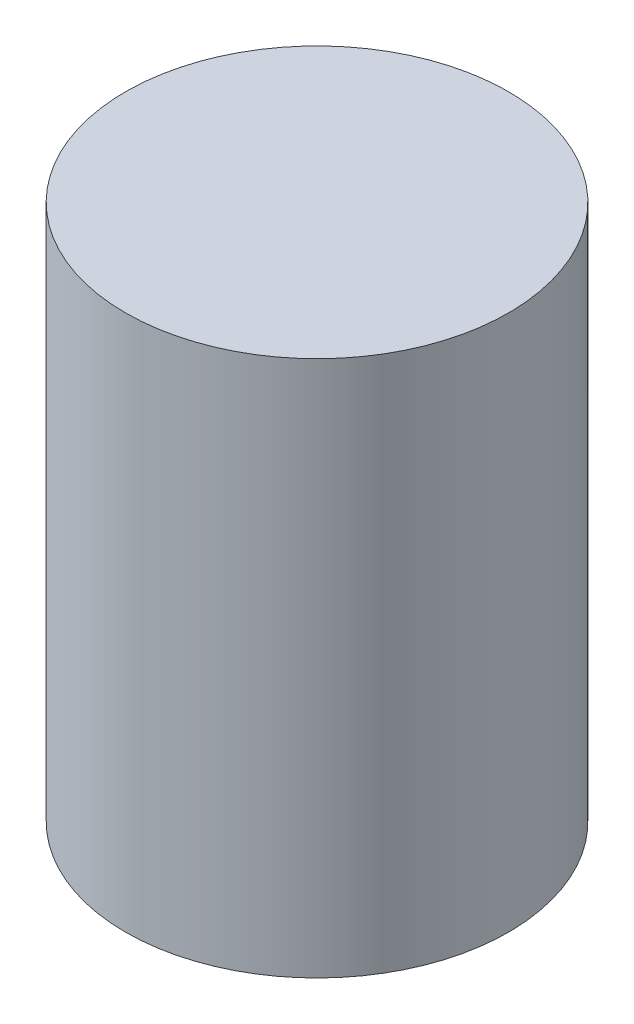
ISO-10303-21;
HEADER;
FILE_DESCRIPTION(('STEP AP214'),'2;1');
FILE_NAME('part.step','',(''),(''),'','','');
FILE_SCHEMA(('AUTOMOTIVE_DESIGN { 1 0 10303 214 1 1 1 1 }'));
ENDSEC;
DATA;
#1=APPLICATION_CONTEXT('core data for automotive mechanical design processes');
#2=APPLICATION_PROTOCOL_DEFINITION('international standard','automotive_design',2000,#1);
#3=PRODUCT_CONTEXT('',#1,'mechanical');
#4=PRODUCT('Part','Part','',(#3));
#5=PRODUCT_RELATED_PRODUCT_CATEGORY('part','',(#4));
#6=PRODUCT_DEFINITION_FORMATION('','',#4);
#7=PRODUCT_DEFINITION_CONTEXT('part definition',#1,'design');
#8=PRODUCT_DEFINITION('design','',#6,#7);
#9=PRODUCT_DEFINITION_SHAPE('','',#8);
#10=(LENGTH_UNIT() NAMED_UNIT(*) SI_UNIT(.MILLI.,.METRE.));
#11=(NAMED_UNIT(*) PLANE_ANGLE_UNIT() SI_UNIT($,.RADIAN.));
#12=(NAMED_UNIT(*) SI_UNIT($,.STERADIAN.) SOLID_ANGLE_UNIT());
#13=UNCERTAINTY_MEASURE_WITH_UNIT(LENGTH_MEASURE(1.E-05),#10,'distance_accuracy_value','');
#14=(GEOMETRIC_REPRESENTATION_CONTEXT(3) GLOBAL_UNCERTAINTY_ASSIGNED_CONTEXT((#13)) GLOBAL_UNIT_ASSIGNED_CONTEXT((#10,
#11,#12)) REPRESENTATION_CONTEXT('',''));
#15=CARTESIAN_POINT('',(0.,0.,0.));
#16=DIRECTION('',(0.,0.,1.));
#17=DIRECTION('',(1.,0.,0.));
#18=AXIS2_PLACEMENT_3D('',#15,#16,#17);
#19=CARTESIAN_POINT('',(0.,140.,0.));
#20=DIRECTION('',(0.,-1.,0.));
#21=DIRECTION('',(0.,0.,-1.));
#22=AXIS2_PLACEMENT_3D('',#19,#20,#21);
#23=CYLINDRICAL_SURFACE('',#22,50.);
#24=CARTESIAN_POINT('',(0.,140.,0.));
#25=DIRECTION('',(0.,1.,0.));
#26=DIRECTION('',(0.,0.,1.));
#27=AXIS2_PLACEMENT_3D('',#24,#25,#26);
#28=CIRCLE('',#27,50.);
#29=CARTESIAN_POINT('',(0.,140.,50.));
#30=VERTEX_POINT('',#29);
#31=EDGE_CURVE('E10',#30,#30,#28,.T.);
#32=ORIENTED_EDGE('',*,*,#31,.F.);
#33=EDGE_LOOP('',(#32));
#34=FACE_BOUND('',#33,.T.);
#35=CARTESIAN_POINT('',(0.,0.,0.));
#36=DIRECTION('',(0.,1.,0.));
#37=DIRECTION('',(0.,0.,1.));
#38=AXIS2_PLACEMENT_3D('',#35,#36,#37);
#39=CIRCLE('',#38,50.);
#40=CARTESIAN_POINT('',(0.,0.,50.));
#41=VERTEX_POINT('',#40);
#42=EDGE_CURVE('E38',#41,#41,#39,.T.);
#43=ORIENTED_EDGE('',*,*,#42,.T.);
#44=EDGE_LOOP('',(#43));
#45=FACE_BOUND('',#44,.T.);
#46=ADVANCED_FACE('F31',(#34,#45),#23,.T.);
#47=CARTESIAN_POINT('',(0.,140.,0.));
#48=DIRECTION('',(0.,1.,0.));
#49=DIRECTION('',(0.,0.,1.));
#50=AXIS2_PLACEMENT_3D('',#47,#48,#49);
#51=PLANE('',#50);
#52=ORIENTED_EDGE('',*,*,#31,.T.);
#53=EDGE_LOOP('',(#52));
#54=FACE_BOUND('',#53,.T.);
#55=ADVANCED_FACE('F73',(#54),#51,.T.);
#56=CARTESIAN_POINT('',(0.,0.,0.));
#57=DIRECTION('',(0.,1.,0.));
#58=DIRECTION('',(0.,0.,1.));
#59=AXIS2_PLACEMENT_3D('',#56,#57,#58);
#60=PLANE('',#59);
#61=CARTESIAN_POINT('',(0.,0.,0.));
#62=DIRECTION('',(0.,-1.,0.));
#63=DIRECTION('',(0.,0.,-1.));
#64=AXIS2_PLACEMENT_3D('',#61,#62,#63);
#65=CIRCLE('',#64,30.);
#66=CARTESIAN_POINT('',(0.,0.,-30.));
#67=VERTEX_POINT('',#66);
#68=EDGE_CURVE('E47',#67,#67,#65,.T.);
#69=ORIENTED_EDGE('',*,*,#68,.F.);
#70=EDGE_LOOP('',(#69));
#71=FACE_BOUND('',#70,.T.);
#72=ORIENTED_EDGE('',*,*,#42,.F.);
#73=EDGE_LOOP('',(#72));
#74=FACE_BOUND('',#73,.T.);
#75=ADVANCED_FACE('F78',(#71,#74),#60,.F.);
#76=CARTESIAN_POINT('',(0.,40.,0.));
#77=DIRECTION('',(0.,-1.,0.));
#78=DIRECTION('',(0.,0.,-1.));
#79=AXIS2_PLACEMENT_3D('',#76,#77,#78);
#80=PLANE('',#79);
#81=CARTESIAN_POINT('',(0.,40.,0.));
#82=DIRECTION('',(0.,-1.,0.));
#83=DIRECTION('',(0.,0.,-1.));
#84=AXIS2_PLACEMENT_3D('',#81,#82,#83);
#85=CIRCLE('',#84,30.);
#86=CARTESIAN_POINT('',(0.,40.,-30.));
#87=VERTEX_POINT('',#86);
#88=EDGE_CURVE('E50',#87,#87,#85,.T.);
#89=ORIENTED_EDGE('',*,*,#88,.T.);
#90=EDGE_LOOP('',(#89));
#91=FACE_BOUND('',#90,.T.);
#92=CARTESIAN_POINT('',(0.,40.,0.));
#93=DIRECTION('',(0.,-1.,0.));
#94=DIRECTION('',(0.,0.,-1.));
#95=AXIS2_PLACEMENT_3D('',#92,#93,#94);
#96=CIRCLE('',#95,10.);
#97=CARTESIAN_POINT('',(0.,40.,-10.));
#98=VERTEX_POINT('',#97);
#99=EDGE_CURVE('E34',#98,#98,#96,.F.);
#100=ORIENTED_EDGE('',*,*,#99,.T.);
#101=EDGE_LOOP('',(#100));
#102=FACE_BOUND('',#101,.T.);
#103=ADVANCED_FACE('F57',(#91,#102),#80,.T.);
#104=CARTESIAN_POINT('',(0.,40.,0.));
#105=DIRECTION('',(0.,-1.,0.));
#106=DIRECTION('',(0.,0.,-1.));
#107=AXIS2_PLACEMENT_3D('',#104,#105,#106);
#108=CYLINDRICAL_SURFACE('',#107,30.);
#109=ORIENTED_EDGE('',*,*,#88,.F.);
#110=EDGE_LOOP('',(#109));
#111=FACE_BOUND('',#110,.T.);
#112=ORIENTED_EDGE('',*,*,#68,.T.);
#113=EDGE_LOOP('',(#112));
#114=FACE_BOUND('',#113,.T.);
#115=ADVANCED_FACE('F67',(#111,#114),#108,.F.);
#116=CARTESIAN_POINT('',(0.,120.,0.));
#117=DIRECTION('',(0.,-1.,0.));
#118=DIRECTION('',(0.,0.,-1.));
#119=AXIS2_PLACEMENT_3D('',#116,#117,#118);
#120=PLANE('',#119);
#121=CARTESIAN_POINT('',(0.,120.,0.));
#122=DIRECTION('',(0.,-1.,0.));
#123=DIRECTION('',(0.,0.,-1.));
#124=AXIS2_PLACEMENT_3D('',#121,#122,#123);
#125=CIRCLE('',#124,10.);
#126=CARTESIAN_POINT('',(0.,120.,-10.));
#127=VERTEX_POINT('',#126);
#128=EDGE_CURVE('E43',#127,#127,#125,.T.);
#129=ORIENTED_EDGE('',*,*,#128,.T.);
#130=EDGE_LOOP('',(#129));
#131=FACE_BOUND('',#130,.T.);
#132=ADVANCED_FACE('F61',(#131),#120,.T.);
#133=CARTESIAN_POINT('',(0.,120.,0.));
#134=DIRECTION('',(0.,-1.,0.));
#135=DIRECTION('',(0.,0.,-1.));
#136=AXIS2_PLACEMENT_3D('',#133,#134,#135);
#137=CYLINDRICAL_SURFACE('',#136,10.);
#138=ORIENTED_EDGE('',*,*,#128,.F.);
#139=EDGE_LOOP('',(#138));
#140=FACE_BOUND('',#139,.T.);
#141=ORIENTED_EDGE('',*,*,#99,.F.);
#142=EDGE_LOOP('',(#141));
#143=FACE_BOUND('',#142,.T.);
#144=ADVANCED_FACE('F59',(#140,#143),#137,.F.);
#145=CLOSED_SHELL('',(#46,#55,#75,#103,#115,#132,#144));
#146=MANIFOLD_SOLID_BREP('B2',#145);
#147=ADVANCED_BREP_SHAPE_REPRESENTATION('',(#18,#146),#14);
#148=SHAPE_DEFINITION_REPRESENTATION(#9,#147);
ENDSEC;
END-ISO-10303-21;
